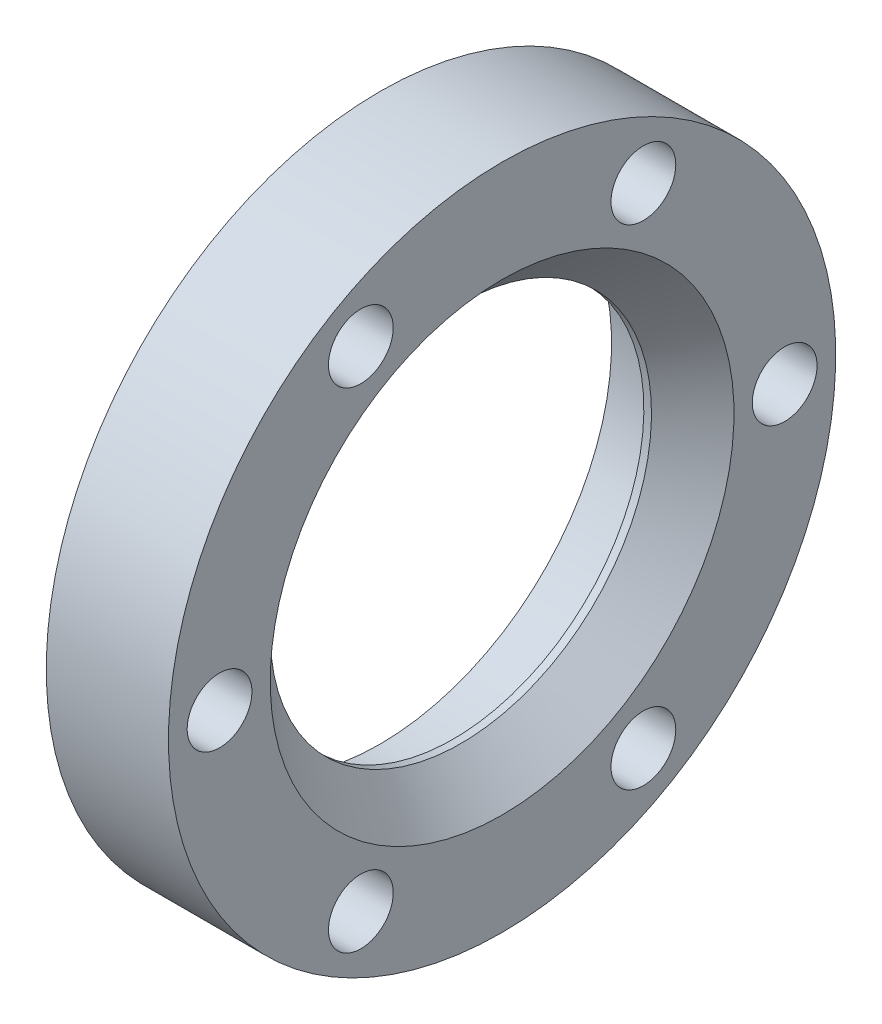
ISO-10303-21;
HEADER;
FILE_DESCRIPTION(('STEP AP214'),'2;1');
FILE_NAME('part.step','',(''),(''),'','','');
FILE_SCHEMA(('AUTOMOTIVE_DESIGN { 1 0 10303 214 1 1 1 1 }'));
ENDSEC;
DATA;
#1=APPLICATION_CONTEXT('core data for automotive mechanical design processes');
#2=APPLICATION_PROTOCOL_DEFINITION('international standard','automotive_design',2000,#1);
#3=PRODUCT_CONTEXT('',#1,'mechanical');
#4=PRODUCT('Part','Part','',(#3));
#5=PRODUCT_RELATED_PRODUCT_CATEGORY('part','',(#4));
#6=PRODUCT_DEFINITION_FORMATION('','',#4);
#7=PRODUCT_DEFINITION_CONTEXT('part definition',#1,'design');
#8=PRODUCT_DEFINITION('design','',#6,#7);
#9=PRODUCT_DEFINITION_SHAPE('','',#8);
#10=(LENGTH_UNIT() NAMED_UNIT(*) SI_UNIT(.MILLI.,.METRE.));
#11=(NAMED_UNIT(*) PLANE_ANGLE_UNIT() SI_UNIT($,.RADIAN.));
#12=(NAMED_UNIT(*) SI_UNIT($,.STERADIAN.) SOLID_ANGLE_UNIT());
#13=UNCERTAINTY_MEASURE_WITH_UNIT(LENGTH_MEASURE(1.E-05),#10,'distance_accuracy_value','');
#14=(GEOMETRIC_REPRESENTATION_CONTEXT(3) GLOBAL_UNCERTAINTY_ASSIGNED_CONTEXT((#13)) GLOBAL_UNIT_ASSIGNED_CONTEXT((#10,
#11,#12)) REPRESENTATION_CONTEXT('',''));
#15=CARTESIAN_POINT('',(0.,0.,0.));
#16=DIRECTION('',(0.,0.,1.));
#17=DIRECTION('',(1.,0.,0.));
#18=AXIS2_PLACEMENT_3D('',#15,#16,#17);
#19=CARTESIAN_POINT('',(8.01687499999896,0.,0.));
#20=DIRECTION('',(1.,0.,0.));
#21=DIRECTION('',(0.,1.,0.));
#22=AXIS2_PLACEMENT_3D('',#19,#20,#21);
#23=CYLINDRICAL_SURFACE('',#22,19.8120000000008);
#24=CARTESIAN_POINT('',(8.41374999807562,0.,0.));
#25=DIRECTION('',(1.,0.,0.));
#26=DIRECTION('',(0.,1.,0.));
#27=AXIS2_PLACEMENT_3D('',#24,#25,#26);
#28=CIRCLE('',#27,19.8120000019241);
#29=CARTESIAN_POINT('',(8.41374999807565,19.8120000019241,0.));
#30=VERTEX_POINT('',#29);
#31=EDGE_CURVE('E75',#30,#30,#28,.T.);
#32=ORIENTED_EDGE('',*,*,#31,.T.);
#33=EDGE_LOOP('',(#32));
#34=FACE_BOUND('',#33,.T.);
#35=CARTESIAN_POINT('',(7.61999999999895,0.,0.));
#36=DIRECTION('',(1.,0.,0.));
#37=DIRECTION('',(0.,1.,0.));
#38=AXIS2_PLACEMENT_3D('',#35,#36,#37);
#39=CIRCLE('',#38,19.8120000000008);
#40=CARTESIAN_POINT('',(7.61999999999898,19.8120000000008,0.));
#41=VERTEX_POINT('',#40);
#42=EDGE_CURVE('E18',#41,#41,#39,.T.);
#43=ORIENTED_EDGE('',*,*,#42,.F.);
#44=EDGE_LOOP('',(#43));
#45=FACE_BOUND('',#44,.T.);
#46=ADVANCED_FACE('F14',(#34,#45),#23,.F.);
#47=CARTESIAN_POINT('',(7.61999999999898,21.9437000000006,0.));
#48=DIRECTION('',(-1.,0.,0.));
#49=DIRECTION('',(0.,0.,1.));
#50=AXIS2_PLACEMENT_3D('',#47,#48,#49);
#51=PLANE('',#50);
#52=ORIENTED_EDGE('',*,*,#42,.T.);
#53=EDGE_LOOP('',(#52));
#54=FACE_BOUND('',#53,.T.);
#55=CARTESIAN_POINT('',(7.61999999999894,0.,0.));
#56=DIRECTION('',(1.,0.,0.));
#57=DIRECTION('',(0.,1.,0.));
#58=AXIS2_PLACEMENT_3D('',#55,#56,#57);
#59=CIRCLE('',#58,24.0754000000004);
#60=CARTESIAN_POINT('',(7.61999999999898,24.0754000000004,0.));
#61=VERTEX_POINT('',#60);
#62=EDGE_CURVE('E73',#61,#61,#59,.F.);
#63=ORIENTED_EDGE('',*,*,#62,.T.);
#64=EDGE_LOOP('',(#63));
#65=FACE_BOUND('',#64,.T.);
#66=ADVANCED_FACE('F84',(#54,#65),#51,.T.);
#67=CARTESIAN_POINT('',(12.7000000019235,0.,0.));
#68=DIRECTION('',(1.,0.,0.));
#69=DIRECTION('',(0.,1.,0.));
#70=AXIS2_PLACEMENT_3D('',#67,#68,#69);
#71=CONICAL_SURFACE('',#70,24.0982499980792,0.78539816250007);
#72=CARTESIAN_POINT('',(12.7000000019235,0.,0.));
#73=DIRECTION('',(1.,0.,0.));
#74=DIRECTION('',(0.,1.,0.));
#75=AXIS2_PLACEMENT_3D('',#72,#73,#74);
#76=CIRCLE('',#75,24.0982499980792);
#77=CARTESIAN_POINT('',(12.7000000019235,24.0982499980792,0.));
#78=VERTEX_POINT('',#77);
#79=EDGE_CURVE('E53',#78,#78,#76,.F.);
#80=ORIENTED_EDGE('',*,*,#79,.F.);
#81=EDGE_LOOP('',(#80));
#82=FACE_BOUND('',#81,.T.);
#83=ORIENTED_EDGE('',*,*,#31,.F.);
#84=EDGE_LOOP('',(#83));
#85=FACE_BOUND('',#84,.T.);
#86=ADVANCED_FACE('F92',(#82,#85),#71,.F.);
#87=CARTESIAN_POINT('',(1.240785174E-13,25.4285843160802,-14.6812));
#88=DIRECTION('',(1.,0.,0.));
#89=DIRECTION('',(0.,0.,-1.));
#90=AXIS2_PLACEMENT_3D('',#87,#88,#89);
#91=CYLINDRICAL_SURFACE('',#90,3.36549999999999);
#92=CARTESIAN_POINT('',(1.35358378E-13,25.4285843160802,-14.6812));
#93=DIRECTION('',(1.,0.,0.));
#94=DIRECTION('',(0.,0.,-1.));
#95=AXIS2_PLACEMENT_3D('',#92,#93,#94);
#96=CIRCLE('',#95,3.36549999999999);
#97=CARTESIAN_POINT('',(1.32693040020406E-13,25.4285843160802,-18.0467));
#98=VERTEX_POINT('',#97);
#99=EDGE_CURVE('E50',#98,#98,#96,.T.);
#100=ORIENTED_EDGE('',*,*,#99,.F.);
#101=EDGE_LOOP('',(#100));
#102=FACE_BOUND('',#101,.T.);
#103=CARTESIAN_POINT('',(12.7000000000002,25.4285843160802,-14.6812));
#104=DIRECTION('',(1.,0.,0.));
#105=DIRECTION('',(0.,0.,-1.));
#106=AXIS2_PLACEMENT_3D('',#103,#104,#105);
#107=CIRCLE('',#106,3.36549999999999);
#108=CARTESIAN_POINT('',(12.7000000000002,25.4285843160802,-18.0467));
#109=VERTEX_POINT('',#108);
#110=EDGE_CURVE('E71',#109,#109,#107,.F.);
#111=ORIENTED_EDGE('',*,*,#110,.F.);
#112=EDGE_LOOP('',(#111));
#113=FACE_BOUND('',#112,.T.);
#114=ADVANCED_FACE('F115',(#102,#113),#91,.F.);
#115=CARTESIAN_POINT('',(0.,0.,-29.3624));
#116=DIRECTION('',(1.,0.,0.));
#117=DIRECTION('',(0.,1.,0.));
#118=AXIS2_PLACEMENT_3D('',#115,#116,#117);
#119=CYLINDRICAL_SURFACE('',#118,3.3655);
#120=CARTESIAN_POINT('',(1.35358378E-13,0.,-29.3624));
#121=DIRECTION('',(1.,0.,0.));
#122=DIRECTION('',(0.,1.,0.));
#123=AXIS2_PLACEMENT_3D('',#120,#121,#122);
#124=CIRCLE('',#123,3.3655);
#125=CARTESIAN_POINT('',(1.414547082E-13,3.3655,-29.3624));
#126=VERTEX_POINT('',#125);
#127=EDGE_CURVE('E47',#126,#126,#124,.T.);
#128=ORIENTED_EDGE('',*,*,#127,.F.);
#129=EDGE_LOOP('',(#128));
#130=FACE_BOUND('',#129,.T.);
#131=CARTESIAN_POINT('',(12.7000000000002,0.,-29.3624));
#132=DIRECTION('',(1.,0.,0.));
#133=DIRECTION('',(0.,1.,0.));
#134=AXIS2_PLACEMENT_3D('',#131,#132,#133);
#135=CIRCLE('',#134,3.3655);
#136=CARTESIAN_POINT('',(12.7000000000002,3.36549999999998,-29.3624));
#137=VERTEX_POINT('',#136);
#138=EDGE_CURVE('E68',#137,#137,#135,.F.);
#139=ORIENTED_EDGE('',*,*,#138,.F.);
#140=EDGE_LOOP('',(#139));
#141=FACE_BOUND('',#140,.T.);
#142=ADVANCED_FACE('F120',(#130,#141),#119,.F.);
#143=CARTESIAN_POINT('',(0.,-25.4285843160802,-14.6812));
#144=DIRECTION('',(1.,0.,0.));
#145=DIRECTION('',(0.,0.,-1.));
#146=AXIS2_PLACEMENT_3D('',#143,#144,#145);
#147=CYLINDRICAL_SURFACE('',#146,3.36549999999999);
#148=CARTESIAN_POINT('',(1.35358378E-13,-25.4285843160802,-14.6812));
#149=DIRECTION('',(1.,0.,0.));
#150=DIRECTION('',(0.,0.,-1.));
#151=AXIS2_PLACEMENT_3D('',#148,#149,#150);
#152=CIRCLE('',#151,3.36549999999999);
#153=CARTESIAN_POINT('',(1.38023707180776E-13,-25.4285843160802,-18.0467));
#154=VERTEX_POINT('',#153);
#155=EDGE_CURVE('E44',#154,#154,#152,.T.);
#156=ORIENTED_EDGE('',*,*,#155,.F.);
#157=EDGE_LOOP('',(#156));
#158=FACE_BOUND('',#157,.T.);
#159=CARTESIAN_POINT('',(12.7000000000002,-25.4285843160802,-14.6812));
#160=DIRECTION('',(1.,0.,0.));
#161=DIRECTION('',(0.,0.,-1.));
#162=AXIS2_PLACEMENT_3D('',#159,#160,#161);
#163=CIRCLE('',#162,3.36549999999999);
#164=CARTESIAN_POINT('',(12.7000000000002,-25.4285843160802,-18.0467));
#165=VERTEX_POINT('',#164);
#166=EDGE_CURVE('E65',#165,#165,#163,.F.);
#167=ORIENTED_EDGE('',*,*,#166,.F.);
#168=EDGE_LOOP('',(#167));
#169=FACE_BOUND('',#168,.T.);
#170=ADVANCED_FACE('F141',(#158,#169),#147,.F.);
#171=CARTESIAN_POINT('',(0.,-25.4285843160802,14.6812));
#172=DIRECTION('',(1.,0.,0.));
#173=DIRECTION('',(0.,0.,-1.));
#174=AXIS2_PLACEMENT_3D('',#171,#172,#173);
#175=CYLINDRICAL_SURFACE('',#174,3.36549999999999);
#176=CARTESIAN_POINT('',(1.35358378E-13,-25.4285843160802,14.6812));
#177=DIRECTION('',(1.,0.,0.));
#178=DIRECTION('',(0.,0.,-1.));
#179=AXIS2_PLACEMENT_3D('',#176,#177,#178);
#180=CIRCLE('',#179,3.36549999999999);
#181=CARTESIAN_POINT('',(1.32795231693552E-13,-25.4285843160802,11.3157));
#182=VERTEX_POINT('',#181);
#183=EDGE_CURVE('E41',#182,#182,#180,.T.);
#184=ORIENTED_EDGE('',*,*,#183,.F.);
#185=EDGE_LOOP('',(#184));
#186=FACE_BOUND('',#185,.T.);
#187=CARTESIAN_POINT('',(12.7000000000002,-25.4285843160802,14.6812));
#188=DIRECTION('',(1.,0.,0.));
#189=DIRECTION('',(0.,0.,-1.));
#190=AXIS2_PLACEMENT_3D('',#187,#188,#189);
#191=CIRCLE('',#190,3.36549999999999);
#192=CARTESIAN_POINT('',(12.7000000000002,-25.4285843160802,11.3157));
#193=VERTEX_POINT('',#192);
#194=EDGE_CURVE('E62',#193,#193,#191,.F.);
#195=ORIENTED_EDGE('',*,*,#194,.F.);
#196=EDGE_LOOP('',(#195));
#197=FACE_BOUND('',#196,.T.);
#198=ADVANCED_FACE('F147',(#186,#197),#175,.F.);
#199=CARTESIAN_POINT('',(1.240785174E-13,25.4285843160802,14.6812));
#200=DIRECTION('',(1.,0.,0.));
#201=DIRECTION('',(0.,0.,-1.));
#202=AXIS2_PLACEMENT_3D('',#199,#200,#201);
#203=CYLINDRICAL_SURFACE('',#202,3.36549999999999);
#204=CARTESIAN_POINT('',(1.35358378E-13,25.4285843160802,14.6812));
#205=DIRECTION('',(1.,0.,0.));
#206=DIRECTION('',(0.,0.,-1.));
#207=AXIS2_PLACEMENT_3D('',#204,#205,#206);
#208=CIRCLE('',#207,3.36549999999999);
#209=CARTESIAN_POINT('',(1.37921517707334E-13,25.4285843160802,11.3157));
#210=VERTEX_POINT('',#209);
#211=EDGE_CURVE('E38',#210,#210,#208,.T.);
#212=ORIENTED_EDGE('',*,*,#211,.F.);
#213=EDGE_LOOP('',(#212));
#214=FACE_BOUND('',#213,.T.);
#215=CARTESIAN_POINT('',(12.7000000000002,25.4285843160802,14.6812));
#216=DIRECTION('',(1.,0.,0.));
#217=DIRECTION('',(0.,0.,-1.));
#218=AXIS2_PLACEMENT_3D('',#215,#216,#217);
#219=CIRCLE('',#218,3.36549999999999);
#220=CARTESIAN_POINT('',(12.7000000000002,25.4285843160802,11.3157));
#221=VERTEX_POINT('',#220);
#222=EDGE_CURVE('E59',#221,#221,#219,.F.);
#223=ORIENTED_EDGE('',*,*,#222,.F.);
#224=EDGE_LOOP('',(#223));
#225=FACE_BOUND('',#224,.T.);
#226=ADVANCED_FACE('F153',(#214,#225),#203,.F.);
#227=CARTESIAN_POINT('',(0.,0.,29.3624));
#228=DIRECTION('',(1.,0.,0.));
#229=DIRECTION('',(0.,1.,0.));
#230=AXIS2_PLACEMENT_3D('',#227,#228,#229);
#231=CYLINDRICAL_SURFACE('',#230,3.3655);
#232=CARTESIAN_POINT('',(1.35358378E-13,0.,29.3624));
#233=DIRECTION('',(1.,0.,0.));
#234=DIRECTION('',(0.,1.,0.));
#235=AXIS2_PLACEMENT_3D('',#232,#233,#234);
#236=CIRCLE('',#235,3.3655);
#237=CARTESIAN_POINT('',(1.413366998E-13,3.3655,29.3624));
#238=VERTEX_POINT('',#237);
#239=EDGE_CURVE('E35',#238,#238,#236,.T.);
#240=ORIENTED_EDGE('',*,*,#239,.F.);
#241=EDGE_LOOP('',(#240));
#242=FACE_BOUND('',#241,.T.);
#243=CARTESIAN_POINT('',(12.7000000000002,0.,29.3624));
#244=DIRECTION('',(1.,0.,0.));
#245=DIRECTION('',(0.,1.,0.));
#246=AXIS2_PLACEMENT_3D('',#243,#244,#245);
#247=CIRCLE('',#246,3.3655);
#248=CARTESIAN_POINT('',(12.7000000000002,3.36549999999998,29.3624));
#249=VERTEX_POINT('',#248);
#250=EDGE_CURVE('E56',#249,#249,#247,.F.);
#251=ORIENTED_EDGE('',*,*,#250,.F.);
#252=EDGE_LOOP('',(#251));
#253=FACE_BOUND('',#252,.T.);
#254=ADVANCED_FACE('F16',(#242,#253),#231,.F.);
#255=CARTESIAN_POINT('',(3.80999999999952,0.,0.));
#256=DIRECTION('',(1.,0.,0.));
#257=DIRECTION('',(0.,1.,0.));
#258=AXIS2_PLACEMENT_3D('',#255,#256,#257);
#259=CYLINDRICAL_SURFACE('',#258,24.0754000000004);
#260=ORIENTED_EDGE('',*,*,#62,.F.);
#261=EDGE_LOOP('',(#260));
#262=FACE_BOUND('',#261,.T.);
#263=CARTESIAN_POINT('',(0.,0.,0.));
#264=DIRECTION('',(1.,0.,0.));
#265=DIRECTION('',(0.,1.,0.));
#266=AXIS2_PLACEMENT_3D('',#263,#264,#265);
#267=CIRCLE('',#266,24.0754000000004);
#268=CARTESIAN_POINT('',(1.35140530413566E-13,24.0754000000004,0.));
#269=VERTEX_POINT('',#268);
#270=EDGE_CURVE('E27',#269,#269,#267,.T.);
#271=ORIENTED_EDGE('',*,*,#270,.F.);
#272=EDGE_LOOP('',(#271));
#273=FACE_BOUND('',#272,.T.);
#274=ADVANCED_FACE('F109',(#262,#273),#259,.F.);
#275=CARTESIAN_POINT('',(12.7000000000002,29.3846250000013,0.));
#276=DIRECTION('',(1.,0.,0.));
#277=DIRECTION('',(0.,0.,-1.));
#278=AXIS2_PLACEMENT_3D('',#275,#276,#277);
#279=PLANE('',#278);
#280=ORIENTED_EDGE('',*,*,#79,.T.);
#281=EDGE_LOOP('',(#280));
#282=FACE_BOUND('',#281,.T.);
#283=ORIENTED_EDGE('',*,*,#250,.T.);
#284=EDGE_LOOP('',(#283));
#285=FACE_BOUND('',#284,.T.);
#286=ORIENTED_EDGE('',*,*,#222,.T.);
#287=EDGE_LOOP('',(#286));
#288=FACE_BOUND('',#287,.T.);
#289=ORIENTED_EDGE('',*,*,#194,.T.);
#290=EDGE_LOOP('',(#289));
#291=FACE_BOUND('',#290,.T.);
#292=ORIENTED_EDGE('',*,*,#166,.T.);
#293=EDGE_LOOP('',(#292));
#294=FACE_BOUND('',#293,.T.);
#295=ORIENTED_EDGE('',*,*,#138,.T.);
#296=EDGE_LOOP('',(#295));
#297=FACE_BOUND('',#296,.T.);
#298=ORIENTED_EDGE('',*,*,#110,.T.);
#299=EDGE_LOOP('',(#298));
#300=FACE_BOUND('',#299,.T.);
#301=CARTESIAN_POINT('',(12.7000000000001,0.,0.));
#302=DIRECTION('',(1.,0.,0.));
#303=DIRECTION('',(0.,1.,0.));
#304=AXIS2_PLACEMENT_3D('',#301,#302,#303);
#305=CIRCLE('',#304,34.6710000000002);
#306=CARTESIAN_POINT('',(12.7000000000002,34.6710000000002,0.));
#307=VERTEX_POINT('',#306);
#308=EDGE_CURVE('E22',#307,#307,#305,.F.);
#309=ORIENTED_EDGE('',*,*,#308,.F.);
#310=EDGE_LOOP('',(#309));
#311=FACE_BOUND('',#310,.T.);
#312=ADVANCED_FACE('F102',(#282,#285,#288,#291,#294,#297,#300,#311),#279,.T.);
#313=CARTESIAN_POINT('',(1.35358378E-13,29.3732000000003,0.));
#314=DIRECTION('',(-1.,0.,0.));
#315=DIRECTION('',(0.,0.,1.));
#316=AXIS2_PLACEMENT_3D('',#313,#314,#315);
#317=PLANE('',#316);
#318=ORIENTED_EDGE('',*,*,#270,.T.);
#319=EDGE_LOOP('',(#318));
#320=FACE_BOUND('',#319,.T.);
#321=ORIENTED_EDGE('',*,*,#239,.T.);
#322=EDGE_LOOP('',(#321));
#323=FACE_BOUND('',#322,.T.);
#324=ORIENTED_EDGE('',*,*,#211,.T.);
#325=EDGE_LOOP('',(#324));
#326=FACE_BOUND('',#325,.T.);
#327=ORIENTED_EDGE('',*,*,#183,.T.);
#328=EDGE_LOOP('',(#327));
#329=FACE_BOUND('',#328,.T.);
#330=ORIENTED_EDGE('',*,*,#155,.T.);
#331=EDGE_LOOP('',(#330));
#332=FACE_BOUND('',#331,.T.);
#333=ORIENTED_EDGE('',*,*,#127,.T.);
#334=EDGE_LOOP('',(#333));
#335=FACE_BOUND('',#334,.T.);
#336=ORIENTED_EDGE('',*,*,#99,.T.);
#337=EDGE_LOOP('',(#336));
#338=FACE_BOUND('',#337,.T.);
#339=CARTESIAN_POINT('',(0.,0.,0.));
#340=DIRECTION('',(1.,0.,0.));
#341=DIRECTION('',(0.,1.,0.));
#342=AXIS2_PLACEMENT_3D('',#339,#340,#341);
#343=CIRCLE('',#342,34.6710000000002);
#344=CARTESIAN_POINT('',(1.35313821276015E-13,34.6710000000002,0.));
#345=VERTEX_POINT('',#344);
#346=EDGE_CURVE('E10',#345,#345,#343,.T.);
#347=ORIENTED_EDGE('',*,*,#346,.F.);
#348=EDGE_LOOP('',(#347));
#349=FACE_BOUND('',#348,.T.);
#350=ADVANCED_FACE('F97',(#320,#323,#326,#329,#332,#335,#338,#349),#317,.T.);
#351=CARTESIAN_POINT('',(6.3500000000001,0.,0.));
#352=DIRECTION('',(1.,0.,0.));
#353=DIRECTION('',(0.,1.,0.));
#354=AXIS2_PLACEMENT_3D('',#351,#352,#353);
#355=CYLINDRICAL_SURFACE('',#354,34.6710000000002);
#356=ORIENTED_EDGE('',*,*,#346,.T.);
#357=EDGE_LOOP('',(#356));
#358=FACE_BOUND('',#357,.T.);
#359=ORIENTED_EDGE('',*,*,#308,.T.);
#360=EDGE_LOOP('',(#359));
#361=FACE_BOUND('',#360,.T.);
#362=ADVANCED_FACE('F95',(#358,#361),#355,.T.);
#363=CLOSED_SHELL('',(#46,#66,#86,#114,#142,#170,#198,#226,#254,#274,#312,#350,#362));
#364=MANIFOLD_SOLID_BREP('B1',#363);
#365=ADVANCED_BREP_SHAPE_REPRESENTATION('',(#18,#364),#14);
#366=SHAPE_DEFINITION_REPRESENTATION(#9,#365);
ENDSEC;
END-ISO-10303-21;
